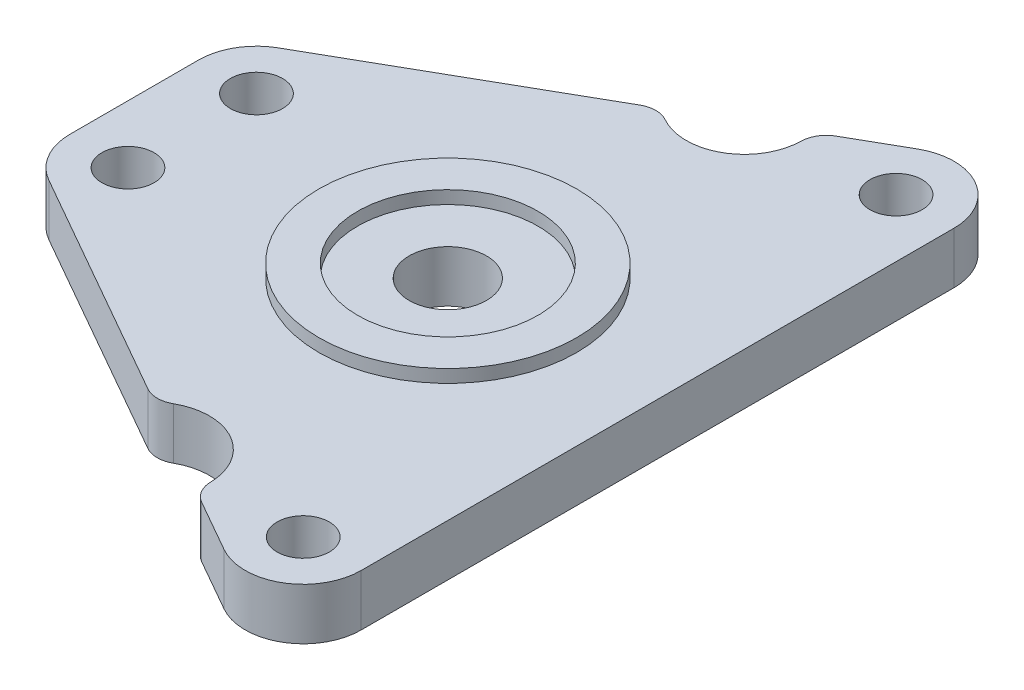
ISO-10303-21;
HEADER;
FILE_DESCRIPTION(('STEP AP214'),'2;1');
FILE_NAME('part.step','',(''),(''),'','','');
FILE_SCHEMA(('AUTOMOTIVE_DESIGN { 1 0 10303 214 1 1 1 1 }'));
ENDSEC;
DATA;
#1=APPLICATION_CONTEXT('core data for automotive mechanical design processes');
#2=APPLICATION_PROTOCOL_DEFINITION('international standard','automotive_design',2000,#1);
#3=PRODUCT_CONTEXT('',#1,'mechanical');
#4=PRODUCT('Part','Part','',(#3));
#5=PRODUCT_RELATED_PRODUCT_CATEGORY('part','',(#4));
#6=PRODUCT_DEFINITION_FORMATION('','',#4);
#7=PRODUCT_DEFINITION_CONTEXT('part definition',#1,'design');
#8=PRODUCT_DEFINITION('design','',#6,#7);
#9=PRODUCT_DEFINITION_SHAPE('','',#8);
#10=(LENGTH_UNIT() NAMED_UNIT(*) SI_UNIT(.MILLI.,.METRE.));
#11=(NAMED_UNIT(*) PLANE_ANGLE_UNIT() SI_UNIT($,.RADIAN.));
#12=(NAMED_UNIT(*) SI_UNIT($,.STERADIAN.) SOLID_ANGLE_UNIT());
#13=UNCERTAINTY_MEASURE_WITH_UNIT(LENGTH_MEASURE(1.E-05),#10,'distance_accuracy_value','');
#14=(GEOMETRIC_REPRESENTATION_CONTEXT(3) GLOBAL_UNCERTAINTY_ASSIGNED_CONTEXT((#13)) GLOBAL_UNIT_ASSIGNED_CONTEXT((#10,
#11,#12)) REPRESENTATION_CONTEXT('',''));
#15=CARTESIAN_POINT('',(0.,0.,0.));
#16=DIRECTION('',(0.,0.,1.));
#17=DIRECTION('',(1.,0.,0.));
#18=AXIS2_PLACEMENT_3D('',#15,#16,#17);
#19=CARTESIAN_POINT('',(4.5,4.,4.985));
#20=DIRECTION('',(0.,1.,0.));
#21=DIRECTION('',(0.,0.,1.));
#22=AXIS2_PLACEMENT_3D('',#19,#20,#21);
#23=PLANE('',#22);
#24=CARTESIAN_POINT('',(4.5,4.,4.985));
#25=DIRECTION('',(0.,1.,0.));
#26=DIRECTION('',(0.,0.,1.));
#27=AXIS2_PLACEMENT_3D('',#24,#25,#26);
#28=CIRCLE('',#27,2.025);
#29=CARTESIAN_POINT('',(4.5,4.,7.01));
#30=VERTEX_POINT('',#29);
#31=EDGE_CURVE('E590',#30,#30,#28,.T.);
#32=ORIENTED_EDGE('',*,*,#31,.F.);
#33=EDGE_LOOP('',(#32));
#34=FACE_BOUND('',#33,.T.);
#35=CARTESIAN_POINT('',(36.11,4.,-23.));
#36=DIRECTION('',(0.,1.,0.));
#37=DIRECTION('',(0.,0.,1.));
#38=AXIS2_PLACEMENT_3D('',#35,#36,#37);
#39=CIRCLE('',#38,2.025);
#40=CARTESIAN_POINT('',(36.11,4.,-20.975));
#41=VERTEX_POINT('',#40);
#42=EDGE_CURVE('E574',#41,#41,#39,.T.);
#43=ORIENTED_EDGE('',*,*,#42,.F.);
#44=EDGE_LOOP('',(#43));
#45=FACE_BOUND('',#44,.T.);
#46=DIRECTION('',(-0.868809195190063,0.,0.495147031045522));
#47=VECTOR('',#46,1.);
#48=CARTESIAN_POINT('',(28.7241660283202,4.,-23.9702086969086));
#49=LINE('',#48,#47);
#50=CARTESIAN_POINT('',(33.8818383602952,4.,-26.9096413783553));
#51=VERTEX_POINT('',#50);
#52=CARTESIAN_POINT('',(29.8383570290859,4.,-24.6052023975981));
#53=VERTEX_POINT('',#52);
#54=EDGE_CURVE('E292',#51,#53,#49,.T.);
#55=ORIENTED_EDGE('',*,*,#54,.T.);
#56=CARTESIAN_POINT('',(30.828651091177,4.,-22.867584007218));
#57=DIRECTION('',(0.,1.,0.));
#58=DIRECTION('',(0.,0.,1.));
#59=AXIS2_PLACEMENT_3D('',#56,#57,#58);
#60=CIRCLE('',#59,2.);
#61=CARTESIAN_POINT('',(28.8290661400456,4.,-22.9083273896124));
#62=VERTEX_POINT('',#61);
#63=EDGE_CURVE('E204',#53,#62,#60,.T.);
#64=ORIENTED_EDGE('',*,*,#63,.T.);
#65=CARTESIAN_POINT('',(24.33,4.,-23.));
#66=DIRECTION('',(0.,-1.,0.));
#67=DIRECTION('',(0.,0.,1.));
#68=AXIS2_PLACEMENT_3D('',#65,#66,#67);
#69=CIRCLE('',#68,4.5);
#70=CARTESIAN_POINT('',(22.11588415881,4.,-19.0823870735113));
#71=VERTEX_POINT('',#70);
#72=EDGE_CURVE('E294',#62,#71,#69,.T.);
#73=ORIENTED_EDGE('',*,*,#72,.T.);
#74=CARTESIAN_POINT('',(21.1318326738367,4.,-17.3412257728496));
#75=DIRECTION('',(0.,1.,0.));
#76=DIRECTION('',(0.,0.,1.));
#77=AXIS2_PLACEMENT_3D('',#74,#75,#76);
#78=CIRCLE('',#77,2.);
#79=CARTESIAN_POINT('',(20.1415386117457,4.,-19.0788441632297));
#80=VERTEX_POINT('',#79);
#81=EDGE_CURVE('E52',#71,#80,#78,.T.);
#82=ORIENTED_EDGE('',*,*,#81,.T.);
#83=DIRECTION('',(-0.868809195190063,0.,0.495147031045523));
#84=VECTOR('',#83,1.);
#85=CARTESIAN_POINT('',(2.27183836029515,4.,-8.89464137835528));
#86=LINE('',#85,#84);
#87=CARTESIAN_POINT('',(2.27183836029515,4.,-8.89464137835528));
#88=VERTEX_POINT('',#87);
#89=EDGE_CURVE('E297',#80,#88,#86,.T.);
#90=ORIENTED_EDGE('',*,*,#89,.T.);
#91=CARTESIAN_POINT('',(4.5,4.,-4.985));
#92=DIRECTION('',(0.,1.,0.));
#93=DIRECTION('',(0.,0.,1.));
#94=AXIS2_PLACEMENT_3D('',#91,#92,#93);
#95=CIRCLE('',#94,4.5);
#96=CARTESIAN_POINT('',(0.,4.,-4.985));
#97=VERTEX_POINT('',#96);
#98=EDGE_CURVE('E303',#88,#97,#95,.T.);
#99=ORIENTED_EDGE('',*,*,#98,.T.);
#100=DIRECTION('',(0.,0.,1.));
#101=VECTOR('',#100,1.);
#102=CARTESIAN_POINT('',(0.,4.,4.985));
#103=LINE('',#102,#101);
#104=CARTESIAN_POINT('',(0.,4.,4.985));
#105=VERTEX_POINT('',#104);
#106=EDGE_CURVE('E166',#97,#105,#103,.T.);
#107=ORIENTED_EDGE('',*,*,#106,.T.);
#108=CARTESIAN_POINT('',(4.5,4.,4.985));
#109=DIRECTION('',(0.,1.,0.));
#110=DIRECTION('',(0.,0.,1.));
#111=AXIS2_PLACEMENT_3D('',#108,#109,#110);
#112=CIRCLE('',#111,4.5);
#113=CARTESIAN_POINT('',(2.27183836029515,4.,8.89464137835528));
#114=VERTEX_POINT('',#113);
#115=EDGE_CURVE('E160',#105,#114,#112,.T.);
#116=ORIENTED_EDGE('',*,*,#115,.T.);
#117=DIRECTION('',(0.868809195190063,0.,0.495147031045523));
#118=VECTOR('',#117,1.);
#119=CARTESIAN_POINT('',(2.27183836029515,4.,8.89464137835528));
#120=LINE('',#119,#118);
#121=CARTESIAN_POINT('',(20.1415386117457,4.,19.0788441632297));
#122=VERTEX_POINT('',#121);
#123=EDGE_CURVE('E150',#114,#122,#120,.T.);
#124=ORIENTED_EDGE('',*,*,#123,.T.);
#125=CARTESIAN_POINT('',(21.1318326738367,4.,17.3412257728496));
#126=DIRECTION('',(0.,1.,0.));
#127=DIRECTION('',(0.,0.,1.));
#128=AXIS2_PLACEMENT_3D('',#125,#126,#127);
#129=CIRCLE('',#128,2.);
#130=CARTESIAN_POINT('',(22.11588415881,4.,19.0823870735113));
#131=VERTEX_POINT('',#130);
#132=EDGE_CURVE('E200',#122,#131,#129,.T.);
#133=ORIENTED_EDGE('',*,*,#132,.T.);
#134=CARTESIAN_POINT('',(24.33,4.,23.));
#135=DIRECTION('',(0.,-1.,0.));
#136=DIRECTION('',(0.,0.,1.));
#137=AXIS2_PLACEMENT_3D('',#134,#135,#136);
#138=CIRCLE('',#137,4.5);
#139=CARTESIAN_POINT('',(28.8290661400456,4.,22.9083273896124));
#140=VERTEX_POINT('',#139);
#141=EDGE_CURVE('E159',#131,#140,#138,.T.);
#142=ORIENTED_EDGE('',*,*,#141,.T.);
#143=CARTESIAN_POINT('',(30.828651091177,4.,22.867584007218));
#144=DIRECTION('',(0.,1.,0.));
#145=DIRECTION('',(0.,0.,1.));
#146=AXIS2_PLACEMENT_3D('',#143,#144,#145);
#147=CIRCLE('',#146,2.);
#148=CARTESIAN_POINT('',(29.8383570290859,4.,24.6052023975981));
#149=VERTEX_POINT('',#148);
#150=EDGE_CURVE('E59',#140,#149,#147,.T.);
#151=ORIENTED_EDGE('',*,*,#150,.T.);
#152=DIRECTION('',(0.868809195190063,0.,0.495147031045522));
#153=VECTOR('',#152,1.);
#154=CARTESIAN_POINT('',(28.7241660283202,4.,23.9702086969086));
#155=LINE('',#154,#153);
#156=CARTESIAN_POINT('',(33.8818383602952,4.,26.9096413783553));
#157=VERTEX_POINT('',#156);
#158=EDGE_CURVE('E223',#149,#157,#155,.T.);
#159=ORIENTED_EDGE('',*,*,#158,.T.);
#160=CARTESIAN_POINT('',(36.11,4.,23.));
#161=DIRECTION('',(0.,1.,0.));
#162=DIRECTION('',(0.,0.,1.));
#163=AXIS2_PLACEMENT_3D('',#160,#161,#162);
#164=CIRCLE('',#163,4.5);
#165=CARTESIAN_POINT('',(40.61,4.,23.));
#166=VERTEX_POINT('',#165);
#167=EDGE_CURVE('E583',#157,#166,#164,.T.);
#168=ORIENTED_EDGE('',*,*,#167,.T.);
#169=DIRECTION('',(0.,0.,-1.));
#170=VECTOR('',#169,1.);
#171=CARTESIAN_POINT('',(40.61,4.,-23.));
#172=LINE('',#171,#170);
#173=CARTESIAN_POINT('',(40.61,4.,-23.));
#174=VERTEX_POINT('',#173);
#175=EDGE_CURVE('E279',#166,#174,#172,.T.);
#176=ORIENTED_EDGE('',*,*,#175,.T.);
#177=CARTESIAN_POINT('',(36.11,4.,-23.));
#178=DIRECTION('',(0.,1.,0.));
#179=DIRECTION('',(0.,0.,1.));
#180=AXIS2_PLACEMENT_3D('',#177,#178,#179);
#181=CIRCLE('',#180,4.5);
#182=EDGE_CURVE('E295',#174,#51,#181,.T.);
#183=ORIENTED_EDGE('',*,*,#182,.T.);
#184=EDGE_LOOP('',(#55,#64,#73,#82,#90,#99,#107,#116,#124,#133,#142,#151,#159,#168,#176,#183));
#185=FACE_BOUND('',#184,.T.);
#186=CARTESIAN_POINT('',(36.11,4.,23.));
#187=DIRECTION('',(0.,1.,0.));
#188=DIRECTION('',(0.,0.,1.));
#189=AXIS2_PLACEMENT_3D('',#186,#187,#188);
#190=CIRCLE('',#189,2.025);
#191=CARTESIAN_POINT('',(36.11,4.,25.025));
#192=VERTEX_POINT('',#191);
#193=EDGE_CURVE('E306',#192,#192,#190,.T.);
#194=ORIENTED_EDGE('',*,*,#193,.F.);
#195=EDGE_LOOP('',(#194));
#196=FACE_BOUND('',#195,.T.);
#197=CARTESIAN_POINT('',(4.5,4.,-4.985));
#198=DIRECTION('',(0.,1.,0.));
#199=DIRECTION('',(0.,0.,1.));
#200=AXIS2_PLACEMENT_3D('',#197,#198,#199);
#201=CIRCLE('',#200,2.025);
#202=CARTESIAN_POINT('',(4.5,4.,-2.96));
#203=VERTEX_POINT('',#202);
#204=EDGE_CURVE('E585',#203,#203,#201,.T.);
#205=ORIENTED_EDGE('',*,*,#204,.F.);
#206=EDGE_LOOP('',(#205));
#207=FACE_BOUND('',#206,.T.);
#208=CARTESIAN_POINT('',(24.33,4.,0.));
#209=DIRECTION('',(0.,1.,0.));
#210=DIRECTION('',(0.,0.,1.));
#211=AXIS2_PLACEMENT_3D('',#208,#209,#210);
#212=CIRCLE('',#211,10.);
#213=CARTESIAN_POINT('',(24.33,4.,10.));
#214=VERTEX_POINT('',#213);
#215=EDGE_CURVE('E605',#214,#214,#212,.T.);
#216=ORIENTED_EDGE('',*,*,#215,.F.);
#217=EDGE_LOOP('',(#216));
#218=FACE_BOUND('',#217,.T.);
#219=ADVANCED_FACE('F37',(#34,#45,#185,#196,#207,#218),#23,.T.);
#220=CARTESIAN_POINT('',(24.33,4.,0.));
#221=DIRECTION('',(0.,1.,0.));
#222=DIRECTION('',(0.,0.,1.));
#223=AXIS2_PLACEMENT_3D('',#220,#221,#222);
#224=CIRCLE('',#223,7.);
#225=CARTESIAN_POINT('',(24.33,4.,7.));
#226=VERTEX_POINT('',#225);
#227=EDGE_CURVE('E175',#226,#226,#224,.F.);
#228=ORIENTED_EDGE('',*,*,#227,.F.);
#229=EDGE_LOOP('',(#228));
#230=FACE_BOUND('',#229,.T.);
#231=CARTESIAN_POINT('',(24.33,4.,0.));
#232=DIRECTION('',(0.,1.,0.));
#233=DIRECTION('',(0.,0.,1.));
#234=AXIS2_PLACEMENT_3D('',#231,#232,#233);
#235=CIRCLE('',#234,3.);
#236=CARTESIAN_POINT('',(24.33,4.,3.));
#237=VERTEX_POINT('',#236);
#238=EDGE_CURVE('E596',#237,#237,#235,.T.);
#239=ORIENTED_EDGE('',*,*,#238,.F.);
#240=EDGE_LOOP('',(#239));
#241=FACE_BOUND('',#240,.T.);
#242=ADVANCED_FACE('F314',(#230,#241),#23,.T.);
#243=CARTESIAN_POINT('',(4.5,0.,4.985));
#244=DIRECTION('',(0.,1.,0.));
#245=DIRECTION('',(0.,0.,1.));
#246=AXIS2_PLACEMENT_3D('',#243,#244,#245);
#247=PLANE('',#246);
#248=CARTESIAN_POINT('',(4.5,0.,4.985));
#249=DIRECTION('',(0.,1.,0.));
#250=DIRECTION('',(0.,0.,1.));
#251=AXIS2_PLACEMENT_3D('',#248,#249,#250);
#252=CIRCLE('',#251,2.025);
#253=CARTESIAN_POINT('',(4.5,0.,7.01));
#254=VERTEX_POINT('',#253);
#255=EDGE_CURVE('E593',#254,#254,#252,.T.);
#256=ORIENTED_EDGE('',*,*,#255,.T.);
#257=EDGE_LOOP('',(#256));
#258=FACE_BOUND('',#257,.T.);
#259=CARTESIAN_POINT('',(36.11,0.,-23.));
#260=DIRECTION('',(0.,1.,0.));
#261=DIRECTION('',(0.,0.,1.));
#262=AXIS2_PLACEMENT_3D('',#259,#260,#261);
#263=CIRCLE('',#262,2.025);
#264=CARTESIAN_POINT('',(36.11,0.,-20.975));
#265=VERTEX_POINT('',#264);
#266=EDGE_CURVE('E578',#265,#265,#263,.T.);
#267=ORIENTED_EDGE('',*,*,#266,.T.);
#268=EDGE_LOOP('',(#267));
#269=FACE_BOUND('',#268,.T.);
#270=CARTESIAN_POINT('',(24.33,0.,-23.));
#271=DIRECTION('',(0.,-1.,0.));
#272=DIRECTION('',(0.,0.,1.));
#273=AXIS2_PLACEMENT_3D('',#270,#271,#272);
#274=CIRCLE('',#273,4.5);
#275=CARTESIAN_POINT('',(28.8290661400456,0.,-22.9083273896124));
#276=VERTEX_POINT('',#275);
#277=CARTESIAN_POINT('',(22.11588415881,0.,-19.0823870735113));
#278=VERTEX_POINT('',#277);
#279=EDGE_CURVE('E252',#276,#278,#274,.T.);
#280=ORIENTED_EDGE('',*,*,#279,.F.);
#281=CARTESIAN_POINT('',(30.828651091177,0.,-22.867584007218));
#282=DIRECTION('',(0.,1.,0.));
#283=DIRECTION('',(0.,0.,1.));
#284=AXIS2_PLACEMENT_3D('',#281,#282,#283);
#285=CIRCLE('',#284,2.);
#286=CARTESIAN_POINT('',(29.8383570290859,0.,-24.6052023975981));
#287=VERTEX_POINT('',#286);
#288=EDGE_CURVE('E196',#276,#287,#285,.F.);
#289=ORIENTED_EDGE('',*,*,#288,.T.);
#290=DIRECTION('',(-0.868809195190063,0.,0.495147031045522));
#291=VECTOR('',#290,1.);
#292=CARTESIAN_POINT('',(28.7241660283202,0.,-23.9702086969086));
#293=LINE('',#292,#291);
#294=CARTESIAN_POINT('',(33.8818383602952,0.,-26.9096413783553));
#295=VERTEX_POINT('',#294);
#296=EDGE_CURVE('E249',#295,#287,#293,.T.);
#297=ORIENTED_EDGE('',*,*,#296,.F.);
#298=CARTESIAN_POINT('',(36.11,0.,-23.));
#299=DIRECTION('',(0.,1.,0.));
#300=DIRECTION('',(0.,0.,1.));
#301=AXIS2_PLACEMENT_3D('',#298,#299,#300);
#302=CIRCLE('',#301,4.5);
#303=CARTESIAN_POINT('',(40.61,0.,-23.));
#304=VERTEX_POINT('',#303);
#305=EDGE_CURVE('E247',#304,#295,#302,.T.);
#306=ORIENTED_EDGE('',*,*,#305,.F.);
#307=DIRECTION('',(0.,0.,-1.));
#308=VECTOR('',#307,1.);
#309=CARTESIAN_POINT('',(40.61,0.,-23.));
#310=LINE('',#309,#308);
#311=CARTESIAN_POINT('',(40.61,0.,23.));
#312=VERTEX_POINT('',#311);
#313=EDGE_CURVE('E240',#312,#304,#310,.T.);
#314=ORIENTED_EDGE('',*,*,#313,.F.);
#315=CARTESIAN_POINT('',(36.11,0.,23.));
#316=DIRECTION('',(0.,1.,0.));
#317=DIRECTION('',(0.,0.,1.));
#318=AXIS2_PLACEMENT_3D('',#315,#316,#317);
#319=CIRCLE('',#318,4.5);
#320=CARTESIAN_POINT('',(33.8818383602952,0.,26.9096413783553));
#321=VERTEX_POINT('',#320);
#322=EDGE_CURVE('E238',#321,#312,#319,.T.);
#323=ORIENTED_EDGE('',*,*,#322,.F.);
#324=DIRECTION('',(0.868809195190063,0.,0.495147031045522));
#325=VECTOR('',#324,1.);
#326=CARTESIAN_POINT('',(28.7241660283202,0.,23.9702086969086));
#327=LINE('',#326,#325);
#328=CARTESIAN_POINT('',(29.8383570290859,0.,24.6052023975981));
#329=VERTEX_POINT('',#328);
#330=EDGE_CURVE('E231',#329,#321,#327,.T.);
#331=ORIENTED_EDGE('',*,*,#330,.F.);
#332=CARTESIAN_POINT('',(30.828651091177,0.,22.867584007218));
#333=DIRECTION('',(0.,1.,0.));
#334=DIRECTION('',(0.,0.,1.));
#335=AXIS2_PLACEMENT_3D('',#332,#333,#334);
#336=CIRCLE('',#335,2.);
#337=CARTESIAN_POINT('',(28.8290661400456,0.,22.9083273896124));
#338=VERTEX_POINT('',#337);
#339=EDGE_CURVE('E192',#329,#338,#336,.F.);
#340=ORIENTED_EDGE('',*,*,#339,.T.);
#341=CARTESIAN_POINT('',(24.33,0.,23.));
#342=DIRECTION('',(0.,-1.,0.));
#343=DIRECTION('',(0.,0.,1.));
#344=AXIS2_PLACEMENT_3D('',#341,#342,#343);
#345=CIRCLE('',#344,4.5);
#346=CARTESIAN_POINT('',(22.11588415881,0.,19.0823870735113));
#347=VERTEX_POINT('',#346);
#348=EDGE_CURVE('E221',#347,#338,#345,.T.);
#349=ORIENTED_EDGE('',*,*,#348,.F.);
#350=CARTESIAN_POINT('',(21.1318326738367,0.,17.3412257728496));
#351=DIRECTION('',(0.,1.,0.));
#352=DIRECTION('',(0.,0.,1.));
#353=AXIS2_PLACEMENT_3D('',#350,#351,#352);
#354=CIRCLE('',#353,2.);
#355=CARTESIAN_POINT('',(20.1415386117457,0.,19.0788441632297));
#356=VERTEX_POINT('',#355);
#357=EDGE_CURVE('E190',#347,#356,#354,.F.);
#358=ORIENTED_EDGE('',*,*,#357,.T.);
#359=DIRECTION('',(0.868809195190063,0.,0.495147031045523));
#360=VECTOR('',#359,1.);
#361=CARTESIAN_POINT('',(2.27183836029515,0.,8.89464137835528));
#362=LINE('',#361,#360);
#363=CARTESIAN_POINT('',(2.27183836029515,0.,8.89464137835528));
#364=VERTEX_POINT('',#363);
#365=EDGE_CURVE('E242',#364,#356,#362,.T.);
#366=ORIENTED_EDGE('',*,*,#365,.F.);
#367=CARTESIAN_POINT('',(4.5,0.,4.985));
#368=DIRECTION('',(0.,1.,0.));
#369=DIRECTION('',(0.,0.,1.));
#370=AXIS2_PLACEMENT_3D('',#367,#368,#369);
#371=CIRCLE('',#370,4.5);
#372=CARTESIAN_POINT('',(0.,0.,4.985));
#373=VERTEX_POINT('',#372);
#374=EDGE_CURVE('E174',#373,#364,#371,.T.);
#375=ORIENTED_EDGE('',*,*,#374,.F.);
#376=DIRECTION('',(0.,0.,1.));
#377=VECTOR('',#376,1.);
#378=CARTESIAN_POINT('',(0.,0.,4.985));
#379=LINE('',#378,#377);
#380=CARTESIAN_POINT('',(0.,0.,-4.985));
#381=VERTEX_POINT('',#380);
#382=EDGE_CURVE('E170',#381,#373,#379,.T.);
#383=ORIENTED_EDGE('',*,*,#382,.F.);
#384=CARTESIAN_POINT('',(4.5,0.,-4.985));
#385=DIRECTION('',(0.,1.,0.));
#386=DIRECTION('',(0.,0.,1.));
#387=AXIS2_PLACEMENT_3D('',#384,#385,#386);
#388=CIRCLE('',#387,4.5);
#389=CARTESIAN_POINT('',(2.27183836029515,0.,-8.89464137835528));
#390=VERTEX_POINT('',#389);
#391=EDGE_CURVE('E257',#390,#381,#388,.T.);
#392=ORIENTED_EDGE('',*,*,#391,.F.);
#393=DIRECTION('',(-0.868809195190063,0.,0.495147031045523));
#394=VECTOR('',#393,1.);
#395=CARTESIAN_POINT('',(2.27183836029515,0.,-8.89464137835528));
#396=LINE('',#395,#394);
#397=CARTESIAN_POINT('',(20.1415386117457,0.,-19.0788441632297));
#398=VERTEX_POINT('',#397);
#399=EDGE_CURVE('E255',#398,#390,#396,.T.);
#400=ORIENTED_EDGE('',*,*,#399,.F.);
#401=CARTESIAN_POINT('',(21.1318326738367,0.,-17.3412257728496));
#402=DIRECTION('',(0.,1.,0.));
#403=DIRECTION('',(0.,0.,1.));
#404=AXIS2_PLACEMENT_3D('',#401,#402,#403);
#405=CIRCLE('',#404,2.);
#406=EDGE_CURVE('E194',#398,#278,#405,.F.);
#407=ORIENTED_EDGE('',*,*,#406,.T.);
#408=EDGE_LOOP('',(#280,#289,#297,#306,#314,#323,#331,#340,#349,#358,#366,#375,#383,#392,#400,#407));
#409=FACE_BOUND('',#408,.T.);
#410=CARTESIAN_POINT('',(36.11,0.,23.));
#411=DIRECTION('',(0.,1.,0.));
#412=DIRECTION('',(0.,0.,1.));
#413=AXIS2_PLACEMENT_3D('',#410,#411,#412);
#414=CIRCLE('',#413,2.025);
#415=CARTESIAN_POINT('',(36.11,0.,25.025));
#416=VERTEX_POINT('',#415);
#417=EDGE_CURVE('E573',#416,#416,#414,.T.);
#418=ORIENTED_EDGE('',*,*,#417,.T.);
#419=EDGE_LOOP('',(#418));
#420=FACE_BOUND('',#419,.T.);
#421=CARTESIAN_POINT('',(4.5,0.,-4.985));
#422=DIRECTION('',(0.,1.,0.));
#423=DIRECTION('',(0.,0.,1.));
#424=AXIS2_PLACEMENT_3D('',#421,#422,#423);
#425=CIRCLE('',#424,2.025);
#426=CARTESIAN_POINT('',(4.5,0.,-2.96));
#427=VERTEX_POINT('',#426);
#428=EDGE_CURVE('E587',#427,#427,#425,.T.);
#429=ORIENTED_EDGE('',*,*,#428,.T.);
#430=EDGE_LOOP('',(#429));
#431=FACE_BOUND('',#430,.T.);
#432=CARTESIAN_POINT('',(24.33,0.,0.));
#433=DIRECTION('',(0.,1.,0.));
#434=DIRECTION('',(0.,0.,1.));
#435=AXIS2_PLACEMENT_3D('',#432,#433,#434);
#436=CIRCLE('',#435,3.);
#437=CARTESIAN_POINT('',(24.33,0.,3.));
#438=VERTEX_POINT('',#437);
#439=EDGE_CURVE('E599',#438,#438,#436,.T.);
#440=ORIENTED_EDGE('',*,*,#439,.T.);
#441=EDGE_LOOP('',(#440));
#442=FACE_BOUND('',#441,.T.);
#443=ADVANCED_FACE('F235',(#258,#269,#409,#420,#431,#442),#247,.F.);
#444=CARTESIAN_POINT('',(4.5,4.,4.985));
#445=DIRECTION('',(0.,-1.,0.));
#446=DIRECTION('',(0.,0.,-1.));
#447=AXIS2_PLACEMENT_3D('',#444,#445,#446);
#448=CYLINDRICAL_SURFACE('',#447,4.5);
#449=ORIENTED_EDGE('',*,*,#374,.T.);
#450=DIRECTION('',(0.,-1.,0.));
#451=VECTOR('',#450,1.);
#452=CARTESIAN_POINT('',(2.27183836029515,4.,8.89464137835528));
#453=LINE('',#452,#451);
#454=EDGE_CURVE('E155',#114,#364,#453,.T.);
#455=ORIENTED_EDGE('',*,*,#454,.F.);
#456=ORIENTED_EDGE('',*,*,#115,.F.);
#457=DIRECTION('',(0.,-1.,0.));
#458=VECTOR('',#457,1.);
#459=CARTESIAN_POINT('',(0.,4.,4.985));
#460=LINE('',#459,#458);
#461=EDGE_CURVE('E260',#105,#373,#460,.T.);
#462=ORIENTED_EDGE('',*,*,#461,.T.);
#463=EDGE_LOOP('',(#449,#455,#456,#462));
#464=FACE_BOUND('',#463,.T.);
#465=ADVANCED_FACE('F172',(#464),#448,.T.);
#466=CARTESIAN_POINT('',(2.27183836029515,4.,8.89464137835528));
#467=DIRECTION('',(0.495147031045523,0.,-0.868809195190063));
#468=DIRECTION('',(-0.868809195190063,0.,-0.495147031045523));
#469=AXIS2_PLACEMENT_3D('',#466,#467,#468);
#470=PLANE('',#469);
#471=ORIENTED_EDGE('',*,*,#365,.T.);
#472=DIRECTION('',(0.,-1.,0.));
#473=VECTOR('',#472,1.);
#474=CARTESIAN_POINT('',(20.1415386117457,4.,19.0788441632297));
#475=LINE('',#474,#473);
#476=EDGE_CURVE('E11',#356,#122,#475,.F.);
#477=ORIENTED_EDGE('',*,*,#476,.T.);
#478=ORIENTED_EDGE('',*,*,#123,.F.);
#479=ORIENTED_EDGE('',*,*,#454,.T.);
#480=EDGE_LOOP('',(#471,#477,#478,#479));
#481=FACE_BOUND('',#480,.T.);
#482=ADVANCED_FACE('F153',(#481),#470,.F.);
#483=CARTESIAN_POINT('',(24.33,4.,23.));
#484=DIRECTION('',(0.,-1.,0.));
#485=DIRECTION('',(0.,0.,-1.));
#486=AXIS2_PLACEMENT_3D('',#483,#484,#485);
#487=CYLINDRICAL_SURFACE('',#486,4.5);
#488=ORIENTED_EDGE('',*,*,#348,.T.);
#489=DIRECTION('',(0.,-1.,0.));
#490=VECTOR('',#489,1.);
#491=CARTESIAN_POINT('',(28.8290661400456,4.,22.9083273896124));
#492=LINE('',#491,#490);
#493=EDGE_CURVE('E45',#338,#140,#492,.F.);
#494=ORIENTED_EDGE('',*,*,#493,.T.);
#495=ORIENTED_EDGE('',*,*,#141,.F.);
#496=DIRECTION('',(0.,-1.,0.));
#497=VECTOR('',#496,1.);
#498=CARTESIAN_POINT('',(22.11588415881,4.,19.0823870735113));
#499=LINE('',#498,#497);
#500=EDGE_CURVE('E212',#131,#347,#499,.T.);
#501=ORIENTED_EDGE('',*,*,#500,.T.);
#502=EDGE_LOOP('',(#488,#494,#495,#501));
#503=FACE_BOUND('',#502,.T.);
#504=ADVANCED_FACE('F218',(#503),#487,.F.);
#505=CARTESIAN_POINT('',(28.7241660283202,4.,23.9702086969086));
#506=DIRECTION('',(0.495147031045522,0.,-0.868809195190063));
#507=DIRECTION('',(-0.868809195190063,0.,-0.495147031045522));
#508=AXIS2_PLACEMENT_3D('',#505,#506,#507);
#509=PLANE('',#508);
#510=ORIENTED_EDGE('',*,*,#158,.F.);
#511=DIRECTION('',(0.,-1.,0.));
#512=VECTOR('',#511,1.);
#513=CARTESIAN_POINT('',(29.8383570290859,4.,24.6052023975981));
#514=LINE('',#513,#512);
#515=EDGE_CURVE('E209',#149,#329,#514,.T.);
#516=ORIENTED_EDGE('',*,*,#515,.T.);
#517=ORIENTED_EDGE('',*,*,#330,.T.);
#518=DIRECTION('',(0.,-1.,0.));
#519=VECTOR('',#518,1.);
#520=CARTESIAN_POINT('',(33.8818383602952,4.,26.9096413783553));
#521=LINE('',#520,#519);
#522=EDGE_CURVE('E176',#157,#321,#521,.T.);
#523=ORIENTED_EDGE('',*,*,#522,.F.);
#524=EDGE_LOOP('',(#510,#516,#517,#523));
#525=FACE_BOUND('',#524,.T.);
#526=ADVANCED_FACE('F229',(#525),#509,.F.);
#527=CARTESIAN_POINT('',(36.11,4.,23.));
#528=DIRECTION('',(0.,-1.,0.));
#529=DIRECTION('',(0.,0.,-1.));
#530=AXIS2_PLACEMENT_3D('',#527,#528,#529);
#531=CYLINDRICAL_SURFACE('',#530,4.5);
#532=ORIENTED_EDGE('',*,*,#322,.T.);
#533=DIRECTION('',(0.,-1.,0.));
#534=VECTOR('',#533,1.);
#535=CARTESIAN_POINT('',(40.61,4.,23.));
#536=LINE('',#535,#534);
#537=EDGE_CURVE('E182',#166,#312,#536,.T.);
#538=ORIENTED_EDGE('',*,*,#537,.F.);
#539=ORIENTED_EDGE('',*,*,#167,.F.);
#540=ORIENTED_EDGE('',*,*,#522,.T.);
#541=EDGE_LOOP('',(#532,#538,#539,#540));
#542=FACE_BOUND('',#541,.T.);
#543=ADVANCED_FACE('F352',(#542),#531,.T.);
#544=CARTESIAN_POINT('',(40.61,4.,-23.));
#545=DIRECTION('',(-1.,0.,0.));
#546=DIRECTION('',(0.,0.,1.));
#547=AXIS2_PLACEMENT_3D('',#544,#545,#546);
#548=PLANE('',#547);
#549=ORIENTED_EDGE('',*,*,#313,.T.);
#550=DIRECTION('',(0.,-1.,0.));
#551=VECTOR('',#550,1.);
#552=CARTESIAN_POINT('',(40.61,4.,-23.));
#553=LINE('',#552,#551);
#554=EDGE_CURVE('E271',#174,#304,#553,.T.);
#555=ORIENTED_EDGE('',*,*,#554,.F.);
#556=ORIENTED_EDGE('',*,*,#175,.F.);
#557=ORIENTED_EDGE('',*,*,#537,.T.);
#558=EDGE_LOOP('',(#549,#555,#556,#557));
#559=FACE_BOUND('',#558,.T.);
#560=ADVANCED_FACE('F277',(#559),#548,.F.);
#561=CARTESIAN_POINT('',(36.11,4.,-23.));
#562=DIRECTION('',(0.,-1.,0.));
#563=DIRECTION('',(0.,0.,-1.));
#564=AXIS2_PLACEMENT_3D('',#561,#562,#563);
#565=CYLINDRICAL_SURFACE('',#564,4.5);
#566=ORIENTED_EDGE('',*,*,#305,.T.);
#567=DIRECTION('',(0.,-1.,0.));
#568=VECTOR('',#567,1.);
#569=CARTESIAN_POINT('',(33.8818383602952,4.,-26.9096413783553));
#570=LINE('',#569,#568);
#571=EDGE_CURVE('E268',#51,#295,#570,.T.);
#572=ORIENTED_EDGE('',*,*,#571,.F.);
#573=ORIENTED_EDGE('',*,*,#182,.F.);
#574=ORIENTED_EDGE('',*,*,#554,.T.);
#575=EDGE_LOOP('',(#566,#572,#573,#574));
#576=FACE_BOUND('',#575,.T.);
#577=ADVANCED_FACE('F286',(#576),#565,.T.);
#578=CARTESIAN_POINT('',(28.7241660283202,4.,-23.9702086969086));
#579=DIRECTION('',(0.495147031045522,0.,0.868809195190063));
#580=DIRECTION('',(0.868809195190063,0.,-0.495147031045522));
#581=AXIS2_PLACEMENT_3D('',#578,#579,#580);
#582=PLANE('',#581);
#583=ORIENTED_EDGE('',*,*,#296,.T.);
#584=DIRECTION('',(0.,-1.,0.));
#585=VECTOR('',#584,1.);
#586=CARTESIAN_POINT('',(29.8383570290859,4.,-24.6052023975981));
#587=LINE('',#586,#585);
#588=EDGE_CURVE('E198',#287,#53,#587,.F.);
#589=ORIENTED_EDGE('',*,*,#588,.T.);
#590=ORIENTED_EDGE('',*,*,#54,.F.);
#591=ORIENTED_EDGE('',*,*,#571,.T.);
#592=EDGE_LOOP('',(#583,#589,#590,#591));
#593=FACE_BOUND('',#592,.T.);
#594=ADVANCED_FACE('F290',(#593),#582,.F.);
#595=CARTESIAN_POINT('',(24.33,4.,-23.));
#596=DIRECTION('',(0.,-1.,0.));
#597=DIRECTION('',(0.,0.,-1.));
#598=AXIS2_PLACEMENT_3D('',#595,#596,#597);
#599=CYLINDRICAL_SURFACE('',#598,4.5);
#600=ORIENTED_EDGE('',*,*,#72,.F.);
#601=DIRECTION('',(0.,-1.,0.));
#602=VECTOR('',#601,1.);
#603=CARTESIAN_POINT('',(28.8290661400456,4.,-22.9083273896124));
#604=LINE('',#603,#602);
#605=EDGE_CURVE('E187',#62,#276,#604,.T.);
#606=ORIENTED_EDGE('',*,*,#605,.T.);
#607=ORIENTED_EDGE('',*,*,#279,.T.);
#608=DIRECTION('',(0.,-1.,0.));
#609=VECTOR('',#608,1.);
#610=CARTESIAN_POINT('',(22.11588415881,4.,-19.0823870735113));
#611=LINE('',#610,#609);
#612=EDGE_CURVE('E179',#278,#71,#611,.F.);
#613=ORIENTED_EDGE('',*,*,#612,.T.);
#614=EDGE_LOOP('',(#600,#606,#607,#613));
#615=FACE_BOUND('',#614,.T.);
#616=ADVANCED_FACE('F341',(#615),#599,.F.);
#617=CARTESIAN_POINT('',(2.27183836029515,4.,-8.89464137835528));
#618=DIRECTION('',(0.495147031045523,0.,0.868809195190063));
#619=DIRECTION('',(0.868809195190063,0.,-0.495147031045523));
#620=AXIS2_PLACEMENT_3D('',#617,#618,#619);
#621=PLANE('',#620);
#622=ORIENTED_EDGE('',*,*,#89,.F.);
#623=DIRECTION('',(0.,-1.,0.));
#624=VECTOR('',#623,1.);
#625=CARTESIAN_POINT('',(20.1415386117457,4.,-19.0788441632297));
#626=LINE('',#625,#624);
#627=EDGE_CURVE('E206',#80,#398,#626,.T.);
#628=ORIENTED_EDGE('',*,*,#627,.T.);
#629=ORIENTED_EDGE('',*,*,#399,.T.);
#630=DIRECTION('',(0.,-1.,0.));
#631=VECTOR('',#630,1.);
#632=CARTESIAN_POINT('',(2.27183836029515,4.,-8.89464137835528));
#633=LINE('',#632,#631);
#634=EDGE_CURVE('E265',#88,#390,#633,.T.);
#635=ORIENTED_EDGE('',*,*,#634,.F.);
#636=EDGE_LOOP('',(#622,#628,#629,#635));
#637=FACE_BOUND('',#636,.T.);
#638=ADVANCED_FACE('F337',(#637),#621,.F.);
#639=CARTESIAN_POINT('',(4.5,4.,-4.985));
#640=DIRECTION('',(0.,-1.,0.));
#641=DIRECTION('',(0.,0.,-1.));
#642=AXIS2_PLACEMENT_3D('',#639,#640,#641);
#643=CYLINDRICAL_SURFACE('',#642,4.5);
#644=ORIENTED_EDGE('',*,*,#391,.T.);
#645=DIRECTION('',(0.,-1.,0.));
#646=VECTOR('',#645,1.);
#647=CARTESIAN_POINT('',(0.,4.,-4.985));
#648=LINE('',#647,#646);
#649=EDGE_CURVE('E262',#97,#381,#648,.T.);
#650=ORIENTED_EDGE('',*,*,#649,.F.);
#651=ORIENTED_EDGE('',*,*,#98,.F.);
#652=ORIENTED_EDGE('',*,*,#634,.T.);
#653=EDGE_LOOP('',(#644,#650,#651,#652));
#654=FACE_BOUND('',#653,.T.);
#655=ADVANCED_FACE('F333',(#654),#643,.T.);
#656=CARTESIAN_POINT('',(0.,4.,4.985));
#657=DIRECTION('',(1.,0.,0.));
#658=DIRECTION('',(0.,0.,-1.));
#659=AXIS2_PLACEMENT_3D('',#656,#657,#658);
#660=PLANE('',#659);
#661=ORIENTED_EDGE('',*,*,#382,.T.);
#662=ORIENTED_EDGE('',*,*,#461,.F.);
#663=ORIENTED_EDGE('',*,*,#106,.F.);
#664=ORIENTED_EDGE('',*,*,#649,.T.);
#665=EDGE_LOOP('',(#661,#662,#663,#664));
#666=FACE_BOUND('',#665,.T.);
#667=ADVANCED_FACE('F330',(#666),#660,.F.);
#668=CARTESIAN_POINT('',(36.11,4.,23.));
#669=DIRECTION('',(0.,-1.,0.));
#670=DIRECTION('',(0.,0.,-1.));
#671=AXIS2_PLACEMENT_3D('',#668,#669,#670);
#672=CYLINDRICAL_SURFACE('',#671,2.025);
#673=ORIENTED_EDGE('',*,*,#193,.T.);
#674=EDGE_LOOP('',(#673));
#675=FACE_BOUND('',#674,.T.);
#676=ORIENTED_EDGE('',*,*,#417,.F.);
#677=EDGE_LOOP('',(#676));
#678=FACE_BOUND('',#677,.T.);
#679=ADVANCED_FACE('F325',(#675,#678),#672,.F.);
#680=CARTESIAN_POINT('',(36.11,4.,-23.));
#681=DIRECTION('',(0.,-1.,0.));
#682=DIRECTION('',(0.,0.,-1.));
#683=AXIS2_PLACEMENT_3D('',#680,#681,#682);
#684=CYLINDRICAL_SURFACE('',#683,2.025);
#685=ORIENTED_EDGE('',*,*,#42,.T.);
#686=EDGE_LOOP('',(#685));
#687=FACE_BOUND('',#686,.T.);
#688=ORIENTED_EDGE('',*,*,#266,.F.);
#689=EDGE_LOOP('',(#688));
#690=FACE_BOUND('',#689,.T.);
#691=ADVANCED_FACE('F460',(#687,#690),#684,.F.);
#692=CARTESIAN_POINT('',(4.5,4.,-4.985));
#693=DIRECTION('',(0.,-1.,0.));
#694=DIRECTION('',(0.,0.,-1.));
#695=AXIS2_PLACEMENT_3D('',#692,#693,#694);
#696=CYLINDRICAL_SURFACE('',#695,2.025);
#697=ORIENTED_EDGE('',*,*,#204,.T.);
#698=EDGE_LOOP('',(#697));
#699=FACE_BOUND('',#698,.T.);
#700=ORIENTED_EDGE('',*,*,#428,.F.);
#701=EDGE_LOOP('',(#700));
#702=FACE_BOUND('',#701,.T.);
#703=ADVANCED_FACE('F451',(#699,#702),#696,.F.);
#704=CARTESIAN_POINT('',(4.5,4.,4.985));
#705=DIRECTION('',(0.,-1.,0.));
#706=DIRECTION('',(0.,0.,-1.));
#707=AXIS2_PLACEMENT_3D('',#704,#705,#706);
#708=CYLINDRICAL_SURFACE('',#707,2.025);
#709=ORIENTED_EDGE('',*,*,#31,.T.);
#710=EDGE_LOOP('',(#709));
#711=FACE_BOUND('',#710,.T.);
#712=ORIENTED_EDGE('',*,*,#255,.F.);
#713=EDGE_LOOP('',(#712));
#714=FACE_BOUND('',#713,.T.);
#715=ADVANCED_FACE('F442',(#711,#714),#708,.F.);
#716=CARTESIAN_POINT('',(24.33,4.,0.));
#717=DIRECTION('',(0.,-1.,0.));
#718=DIRECTION('',(0.,0.,-1.));
#719=AXIS2_PLACEMENT_3D('',#716,#717,#718);
#720=CYLINDRICAL_SURFACE('',#719,3.);
#721=ORIENTED_EDGE('',*,*,#238,.T.);
#722=EDGE_LOOP('',(#721));
#723=FACE_BOUND('',#722,.T.);
#724=ORIENTED_EDGE('',*,*,#439,.F.);
#725=EDGE_LOOP('',(#724));
#726=FACE_BOUND('',#725,.T.);
#727=ADVANCED_FACE('F427',(#723,#726),#720,.F.);
#728=CARTESIAN_POINT('',(24.33,5.,0.));
#729=DIRECTION('',(0.,1.,0.));
#730=DIRECTION('',(0.,0.,1.));
#731=AXIS2_PLACEMENT_3D('',#728,#729,#730);
#732=PLANE('',#731);
#733=CARTESIAN_POINT('',(24.33,5.,0.));
#734=DIRECTION('',(0.,1.,0.));
#735=DIRECTION('',(0.,0.,1.));
#736=AXIS2_PLACEMENT_3D('',#733,#734,#735);
#737=CIRCLE('',#736,10.);
#738=CARTESIAN_POINT('',(24.33,5.,10.));
#739=VERTEX_POINT('',#738);
#740=EDGE_CURVE('E602',#739,#739,#737,.T.);
#741=ORIENTED_EDGE('',*,*,#740,.T.);
#742=EDGE_LOOP('',(#741));
#743=FACE_BOUND('',#742,.T.);
#744=CARTESIAN_POINT('',(24.33,5.,0.));
#745=DIRECTION('',(0.,1.,0.));
#746=DIRECTION('',(0.,0.,1.));
#747=AXIS2_PLACEMENT_3D('',#744,#745,#746);
#748=CIRCLE('',#747,7.);
#749=CARTESIAN_POINT('',(24.33,5.,7.));
#750=VERTEX_POINT('',#749);
#751=EDGE_CURVE('E608',#750,#750,#748,.T.);
#752=ORIENTED_EDGE('',*,*,#751,.F.);
#753=EDGE_LOOP('',(#752));
#754=FACE_BOUND('',#753,.T.);
#755=ADVANCED_FACE('F418',(#743,#754),#732,.T.);
#756=CARTESIAN_POINT('',(24.33,5.,0.));
#757=DIRECTION('',(0.,-1.,0.));
#758=DIRECTION('',(0.,0.,-1.));
#759=AXIS2_PLACEMENT_3D('',#756,#757,#758);
#760=CYLINDRICAL_SURFACE('',#759,10.);
#761=ORIENTED_EDGE('',*,*,#740,.F.);
#762=EDGE_LOOP('',(#761));
#763=FACE_BOUND('',#762,.T.);
#764=ORIENTED_EDGE('',*,*,#215,.T.);
#765=EDGE_LOOP('',(#764));
#766=FACE_BOUND('',#765,.T.);
#767=ADVANCED_FACE('F409',(#763,#766),#760,.T.);
#768=CARTESIAN_POINT('',(24.33,5.,0.));
#769=DIRECTION('',(0.,-1.,0.));
#770=DIRECTION('',(0.,0.,-1.));
#771=AXIS2_PLACEMENT_3D('',#768,#769,#770);
#772=CYLINDRICAL_SURFACE('',#771,7.);
#773=ORIENTED_EDGE('',*,*,#751,.T.);
#774=EDGE_LOOP('',(#773));
#775=FACE_BOUND('',#774,.T.);
#776=ORIENTED_EDGE('',*,*,#227,.T.);
#777=EDGE_LOOP('',(#776));
#778=FACE_BOUND('',#777,.T.);
#779=ADVANCED_FACE('F366',(#775,#778),#772,.F.);
#780=CARTESIAN_POINT('',(30.828651091177,4.,-22.867584007218));
#781=DIRECTION('',(0.,-1.,0.));
#782=DIRECTION('',(0.,0.,-1.));
#783=AXIS2_PLACEMENT_3D('',#780,#781,#782);
#784=CYLINDRICAL_SURFACE('',#783,2.);
#785=ORIENTED_EDGE('',*,*,#63,.F.);
#786=ORIENTED_EDGE('',*,*,#588,.F.);
#787=ORIENTED_EDGE('',*,*,#288,.F.);
#788=ORIENTED_EDGE('',*,*,#605,.F.);
#789=EDGE_LOOP('',(#785,#786,#787,#788));
#790=FACE_BOUND('',#789,.T.);
#791=ADVANCED_FACE('F363',(#790),#784,.T.);
#792=CARTESIAN_POINT('',(21.1318326738367,4.,-17.3412257728496));
#793=DIRECTION('',(0.,-1.,0.));
#794=DIRECTION('',(0.,0.,-1.));
#795=AXIS2_PLACEMENT_3D('',#792,#793,#794);
#796=CYLINDRICAL_SURFACE('',#795,2.);
#797=ORIENTED_EDGE('',*,*,#81,.F.);
#798=ORIENTED_EDGE('',*,*,#612,.F.);
#799=ORIENTED_EDGE('',*,*,#406,.F.);
#800=ORIENTED_EDGE('',*,*,#627,.F.);
#801=EDGE_LOOP('',(#797,#798,#799,#800));
#802=FACE_BOUND('',#801,.T.);
#803=ADVANCED_FACE('F312',(#802),#796,.T.);
#804=CARTESIAN_POINT('',(30.828651091177,4.,22.867584007218));
#805=DIRECTION('',(0.,-1.,0.));
#806=DIRECTION('',(0.,0.,-1.));
#807=AXIS2_PLACEMENT_3D('',#804,#805,#806);
#808=CYLINDRICAL_SURFACE('',#807,2.);
#809=ORIENTED_EDGE('',*,*,#150,.F.);
#810=ORIENTED_EDGE('',*,*,#493,.F.);
#811=ORIENTED_EDGE('',*,*,#339,.F.);
#812=ORIENTED_EDGE('',*,*,#515,.F.);
#813=EDGE_LOOP('',(#809,#810,#811,#812));
#814=FACE_BOUND('',#813,.T.);
#815=ADVANCED_FACE('F226',(#814),#808,.T.);
#816=CARTESIAN_POINT('',(21.1318326738367,4.,17.3412257728496));
#817=DIRECTION('',(0.,-1.,0.));
#818=DIRECTION('',(0.,0.,-1.));
#819=AXIS2_PLACEMENT_3D('',#816,#817,#818);
#820=CYLINDRICAL_SURFACE('',#819,2.);
#821=ORIENTED_EDGE('',*,*,#132,.F.);
#822=ORIENTED_EDGE('',*,*,#476,.F.);
#823=ORIENTED_EDGE('',*,*,#357,.F.);
#824=ORIENTED_EDGE('',*,*,#500,.F.);
#825=EDGE_LOOP('',(#821,#822,#823,#824));
#826=FACE_BOUND('',#825,.T.);
#827=ADVANCED_FACE('F39',(#826),#820,.T.);
#828=CLOSED_SHELL('',(#219,#242,#443,#465,#482,#504,#526,#543,#560,#577,#594,#616,#638,#655,
#667,#679,#691,#703,#715,#727,#755,#767,#779,#791,#803,#815,#827));
#829=MANIFOLD_SOLID_BREP('B2',#828);
#830=ADVANCED_BREP_SHAPE_REPRESENTATION('',(#18,#829),#14);
#831=SHAPE_DEFINITION_REPRESENTATION(#9,#830);
ENDSEC;
END-ISO-10303-21;
